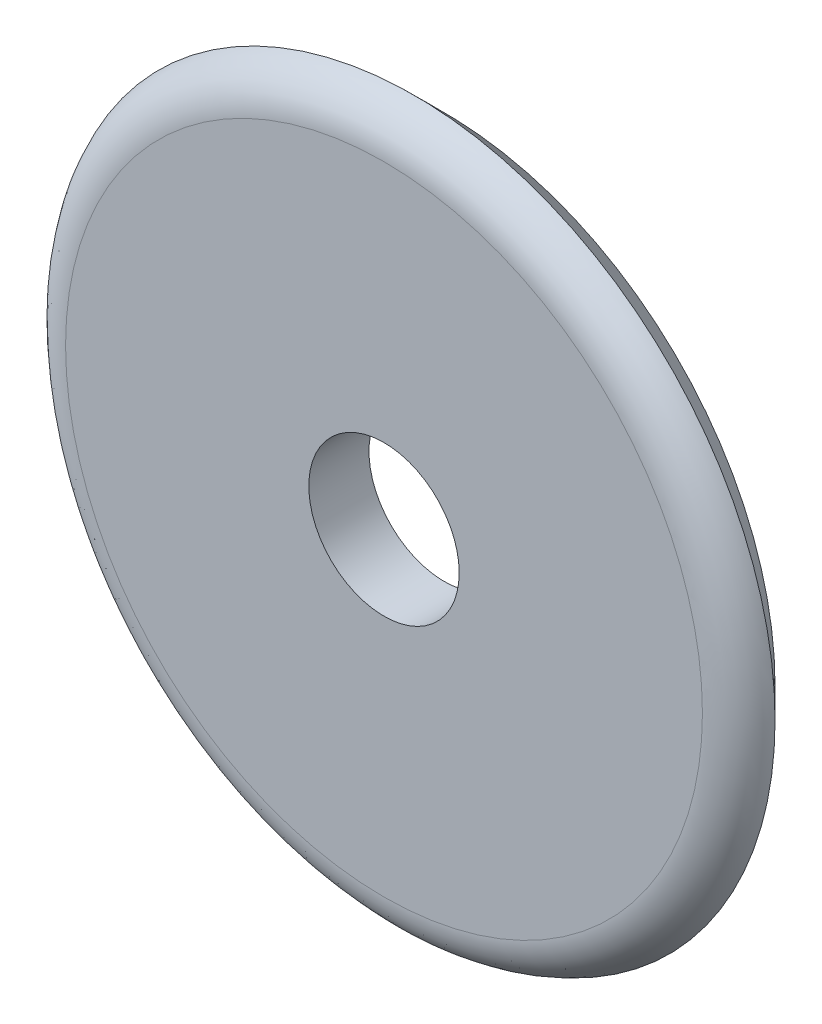
ISO-10303-21;
HEADER;
FILE_DESCRIPTION(('STEP AP214'),'2;1');
FILE_NAME('part.step','',(''),(''),'','','');
FILE_SCHEMA(('AUTOMOTIVE_DESIGN { 1 0 10303 214 1 1 1 1 }'));
ENDSEC;
DATA;
#1=APPLICATION_CONTEXT('core data for automotive mechanical design processes');
#2=APPLICATION_PROTOCOL_DEFINITION('international standard','automotive_design',2000,#1);
#3=PRODUCT_CONTEXT('',#1,'mechanical');
#4=PRODUCT('Part','Part','',(#3));
#5=PRODUCT_RELATED_PRODUCT_CATEGORY('part','',(#4));
#6=PRODUCT_DEFINITION_FORMATION('','',#4);
#7=PRODUCT_DEFINITION_CONTEXT('part definition',#1,'design');
#8=PRODUCT_DEFINITION('design','',#6,#7);
#9=PRODUCT_DEFINITION_SHAPE('','',#8);
#10=(LENGTH_UNIT() NAMED_UNIT(*) SI_UNIT(.MILLI.,.METRE.));
#11=(NAMED_UNIT(*) PLANE_ANGLE_UNIT() SI_UNIT($,.RADIAN.));
#12=(NAMED_UNIT(*) SI_UNIT($,.STERADIAN.) SOLID_ANGLE_UNIT());
#13=UNCERTAINTY_MEASURE_WITH_UNIT(LENGTH_MEASURE(1.E-05),#10,'distance_accuracy_value','');
#14=(GEOMETRIC_REPRESENTATION_CONTEXT(3) GLOBAL_UNCERTAINTY_ASSIGNED_CONTEXT((#13)) GLOBAL_UNIT_ASSIGNED_CONTEXT((#10,
#11,#12)) REPRESENTATION_CONTEXT('',''));
#15=CARTESIAN_POINT('',(0.,0.,0.));
#16=DIRECTION('',(0.,0.,1.));
#17=DIRECTION('',(1.,0.,0.));
#18=AXIS2_PLACEMENT_3D('',#15,#16,#17);
#19=CARTESIAN_POINT('',(0.,0.,2.));
#20=DIRECTION('',(0.,0.,1.));
#21=DIRECTION('',(1.,0.,0.));
#22=AXIS2_PLACEMENT_3D('',#19,#20,#21);
#23=PLANE('',#22);
#24=CARTESIAN_POINT('',(0.,0.,2.));
#25=DIRECTION('',(0.,0.,1.));
#26=DIRECTION('',(1.,0.,0.));
#27=AXIS2_PLACEMENT_3D('',#24,#25,#26);
#28=CIRCLE('',#27,10.5857864376269);
#29=CARTESIAN_POINT('',(10.5857864376269,0.,2.));
#30=VERTEX_POINT('',#29);
#31=EDGE_CURVE('E30',#30,#30,#28,.F.);
#32=ORIENTED_EDGE('',*,*,#31,.F.);
#33=EDGE_LOOP('',(#32));
#34=FACE_BOUND('',#33,.T.);
#35=CARTESIAN_POINT('',(0.,0.,2.));
#36=DIRECTION('',(0.,0.,1.));
#37=DIRECTION('',(1.,0.,0.));
#38=AXIS2_PLACEMENT_3D('',#35,#36,#37);
#39=CIRCLE('',#38,2.5);
#40=CARTESIAN_POINT('',(2.5,0.,2.));
#41=VERTEX_POINT('',#40);
#42=EDGE_CURVE('E19',#41,#41,#39,.F.);
#43=ORIENTED_EDGE('',*,*,#42,.T.);
#44=EDGE_LOOP('',(#43));
#45=FACE_BOUND('',#44,.T.);
#46=ADVANCED_FACE('F15',(#34,#45),#23,.T.);
#47=CARTESIAN_POINT('',(0.,0.,0.499999999999993));
#48=DIRECTION('',(0.,0.,1.));
#49=DIRECTION('',(1.,0.,0.));
#50=AXIS2_PLACEMENT_3D('',#47,#48,#49);
#51=TOROIDAL_SURFACE('',#50,10.5857864376269,1.5);
#52=ORIENTED_EDGE('',*,*,#31,.T.);
#53=EDGE_LOOP('',(#52));
#54=FACE_BOUND('',#53,.T.);
#55=CARTESIAN_POINT('',(0.,0.,0.999999999998724));
#56=DIRECTION('',(0.,0.,1.));
#57=DIRECTION('',(1.,0.,0.));
#58=AXIS2_PLACEMENT_3D('',#55,#56,#57);
#59=CIRCLE('',#58,12.0000000000013);
#60=CARTESIAN_POINT('',(12.0000000000013,0.,0.999999999998724));
#61=VERTEX_POINT('',#60);
#62=EDGE_CURVE('E28',#61,#61,#59,.F.);
#63=ORIENTED_EDGE('',*,*,#62,.F.);
#64=EDGE_LOOP('',(#63));
#65=FACE_BOUND('',#64,.T.);
#66=ADVANCED_FACE('F17',(#54,#65),#51,.T.);
#67=CARTESIAN_POINT('',(0.,0.,0.));
#68=DIRECTION('',(0.,0.,1.));
#69=DIRECTION('',(1.,0.,0.));
#70=AXIS2_PLACEMENT_3D('',#67,#68,#69);
#71=CYLINDRICAL_SURFACE('',#70,2.5);
#72=ORIENTED_EDGE('',*,*,#42,.F.);
#73=EDGE_LOOP('',(#72));
#74=FACE_BOUND('',#73,.T.);
#75=CARTESIAN_POINT('',(0.,0.,0.));
#76=DIRECTION('',(0.,0.,1.));
#77=DIRECTION('',(1.,0.,0.));
#78=AXIS2_PLACEMENT_3D('',#75,#76,#77);
#79=CIRCLE('',#78,2.5);
#80=CARTESIAN_POINT('',(2.5,0.,0.));
#81=VERTEX_POINT('',#80);
#82=EDGE_CURVE('E23',#81,#81,#79,.F.);
#83=ORIENTED_EDGE('',*,*,#82,.T.);
#84=EDGE_LOOP('',(#83));
#85=FACE_BOUND('',#84,.T.);
#86=ADVANCED_FACE('F40',(#74,#85),#71,.F.);
#87=CARTESIAN_POINT('',(0.,0.,0.999999999998724));
#88=DIRECTION('',(0.,0.,1.));
#89=DIRECTION('',(1.,0.,0.));
#90=AXIS2_PLACEMENT_3D('',#87,#88,#89);
#91=CONICAL_SURFACE('',#90,12.0000000000013,0.7853981634);
#92=ORIENTED_EDGE('',*,*,#62,.T.);
#93=EDGE_LOOP('',(#92));
#94=FACE_BOUND('',#93,.T.);
#95=CARTESIAN_POINT('',(0.,0.,1.27632279744994E-12));
#96=DIRECTION('',(0.,0.,1.));
#97=DIRECTION('',(1.,0.,0.));
#98=AXIS2_PLACEMENT_3D('',#95,#96,#97);
#99=CIRCLE('',#98,10.9999999999987);
#100=CARTESIAN_POINT('',(10.9999999999987,0.,1.27632279744994E-12));
#101=VERTEX_POINT('',#100);
#102=EDGE_CURVE('E10',#101,#101,#99,.T.);
#103=ORIENTED_EDGE('',*,*,#102,.T.);
#104=EDGE_LOOP('',(#103));
#105=FACE_BOUND('',#104,.T.);
#106=ADVANCED_FACE('F43',(#94,#105),#91,.T.);
#107=CARTESIAN_POINT('',(0.,0.,0.));
#108=DIRECTION('',(0.,0.,1.));
#109=DIRECTION('',(1.,0.,0.));
#110=AXIS2_PLACEMENT_3D('',#107,#108,#109);
#111=PLANE('',#110);
#112=ORIENTED_EDGE('',*,*,#102,.F.);
#113=EDGE_LOOP('',(#112));
#114=FACE_BOUND('',#113,.T.);
#115=ORIENTED_EDGE('',*,*,#82,.F.);
#116=EDGE_LOOP('',(#115));
#117=FACE_BOUND('',#116,.T.);
#118=ADVANCED_FACE('F47',(#114,#117),#111,.F.);
#119=CLOSED_SHELL('',(#46,#66,#86,#106,#118));
#120=MANIFOLD_SOLID_BREP('B1',#119);
#121=ADVANCED_BREP_SHAPE_REPRESENTATION('',(#18,#120),#14);
#122=SHAPE_DEFINITION_REPRESENTATION(#9,#121);
ENDSEC;
END-ISO-10303-21;
